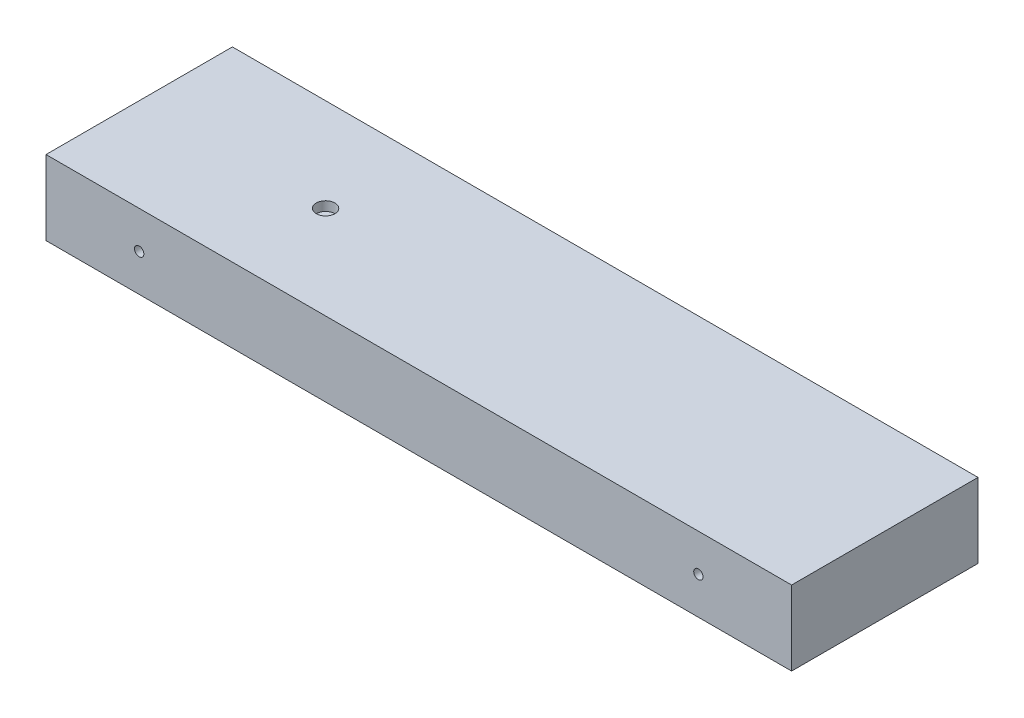
ISO-10303-21;
HEADER;
FILE_DESCRIPTION(('STEP AP214'),'2;1');
FILE_NAME('part.step','',(''),(''),'','','');
FILE_SCHEMA(('AUTOMOTIVE_DESIGN { 1 0 10303 214 1 1 1 1 }'));
ENDSEC;
DATA;
#1=APPLICATION_CONTEXT('core data for automotive mechanical design processes');
#2=APPLICATION_PROTOCOL_DEFINITION('international standard','automotive_design',2000,#1);
#3=PRODUCT_CONTEXT('',#1,'mechanical');
#4=PRODUCT('Part','Part','',(#3));
#5=PRODUCT_RELATED_PRODUCT_CATEGORY('part','',(#4));
#6=PRODUCT_DEFINITION_FORMATION('','',#4);
#7=PRODUCT_DEFINITION_CONTEXT('part definition',#1,'design');
#8=PRODUCT_DEFINITION('design','',#6,#7);
#9=PRODUCT_DEFINITION_SHAPE('','',#8);
#10=(LENGTH_UNIT() NAMED_UNIT(*) SI_UNIT(.MILLI.,.METRE.));
#11=(NAMED_UNIT(*) PLANE_ANGLE_UNIT() SI_UNIT($,.RADIAN.));
#12=(NAMED_UNIT(*) SI_UNIT($,.STERADIAN.) SOLID_ANGLE_UNIT());
#13=UNCERTAINTY_MEASURE_WITH_UNIT(LENGTH_MEASURE(1.E-05),#10,'distance_accuracy_value','');
#14=(GEOMETRIC_REPRESENTATION_CONTEXT(3) GLOBAL_UNCERTAINTY_ASSIGNED_CONTEXT((#13)) GLOBAL_UNIT_ASSIGNED_CONTEXT((#10,
#11,#12)) REPRESENTATION_CONTEXT('',''));
#15=CARTESIAN_POINT('',(0.,0.,0.));
#16=DIRECTION('',(0.,0.,1.));
#17=DIRECTION('',(1.,0.,0.));
#18=AXIS2_PLACEMENT_3D('',#15,#16,#17);
#19=CARTESIAN_POINT('',(0.,80.,0.));
#20=DIRECTION('',(1.,0.,0.));
#21=DIRECTION('',(0.,0.,-1.));
#22=AXIS2_PLACEMENT_3D('',#19,#20,#21);
#23=PLANE('',#22);
#24=DIRECTION('',(0.,0.,1.));
#25=VECTOR('',#24,1.);
#26=CARTESIAN_POINT('',(0.,0.,0.));
#27=LINE('',#26,#25);
#28=CARTESIAN_POINT('',(0.,0.,-200.));
#29=VERTEX_POINT('',#28);
#30=CARTESIAN_POINT('',(0.,0.,0.));
#31=VERTEX_POINT('',#30);
#32=EDGE_CURVE('E106',#29,#31,#27,.T.);
#33=ORIENTED_EDGE('',*,*,#32,.T.);
#34=DIRECTION('',(0.,-1.,0.));
#35=VECTOR('',#34,1.);
#36=CARTESIAN_POINT('',(0.,80.,0.));
#37=LINE('',#36,#35);
#38=CARTESIAN_POINT('',(0.,80.,0.));
#39=VERTEX_POINT('',#38);
#40=EDGE_CURVE('E11',#39,#31,#37,.T.);
#41=ORIENTED_EDGE('',*,*,#40,.F.);
#42=DIRECTION('',(0.,0.,1.));
#43=VECTOR('',#42,1.);
#44=CARTESIAN_POINT('',(0.,80.,0.));
#45=LINE('',#44,#43);
#46=CARTESIAN_POINT('',(0.,80.,-200.));
#47=VERTEX_POINT('',#46);
#48=EDGE_CURVE('E90',#47,#39,#45,.T.);
#49=ORIENTED_EDGE('',*,*,#48,.F.);
#50=DIRECTION('',(0.,-1.,0.));
#51=VECTOR('',#50,1.);
#52=CARTESIAN_POINT('',(0.,80.,-200.));
#53=LINE('',#52,#51);
#54=EDGE_CURVE('E102',#47,#29,#53,.T.);
#55=ORIENTED_EDGE('',*,*,#54,.T.);
#56=EDGE_LOOP('',(#33,#41,#49,#55));
#57=FACE_BOUND('',#56,.T.);
#58=ADVANCED_FACE('F38',(#57),#23,.F.);
#59=CARTESIAN_POINT('',(0.,80.,0.));
#60=DIRECTION('',(0.,0.,-1.));
#61=DIRECTION('',(-1.,0.,0.));
#62=AXIS2_PLACEMENT_3D('',#59,#60,#61);
#63=PLANE('',#62);
#64=CARTESIAN_POINT('',(100.,40.,0.));
#65=DIRECTION('',(0.,0.,1.));
#66=DIRECTION('',(1.,0.,0.));
#67=AXIS2_PLACEMENT_3D('',#64,#65,#66);
#68=CIRCLE('',#67,4.99999999999999);
#69=CARTESIAN_POINT('',(105.,40.,0.));
#70=VERTEX_POINT('',#69);
#71=EDGE_CURVE('E136',#70,#70,#68,.T.);
#72=ORIENTED_EDGE('',*,*,#71,.F.);
#73=EDGE_LOOP('',(#72));
#74=FACE_BOUND('',#73,.T.);
#75=CARTESIAN_POINT('',(700.,40.,0.));
#76=DIRECTION('',(0.,0.,1.));
#77=DIRECTION('',(1.,0.,0.));
#78=AXIS2_PLACEMENT_3D('',#75,#76,#77);
#79=CIRCLE('',#78,5.00000000000005);
#80=CARTESIAN_POINT('',(705.,40.,0.));
#81=VERTEX_POINT('',#80);
#82=EDGE_CURVE('E127',#81,#81,#79,.T.);
#83=ORIENTED_EDGE('',*,*,#82,.F.);
#84=EDGE_LOOP('',(#83));
#85=FACE_BOUND('',#84,.T.);
#86=DIRECTION('',(1.,0.,0.));
#87=VECTOR('',#86,1.);
#88=CARTESIAN_POINT('',(0.,0.,0.));
#89=LINE('',#88,#87);
#90=CARTESIAN_POINT('',(800.,0.,0.));
#91=VERTEX_POINT('',#90);
#92=EDGE_CURVE('E95',#31,#91,#89,.T.);
#93=ORIENTED_EDGE('',*,*,#92,.T.);
#94=DIRECTION('',(0.,-1.,0.));
#95=VECTOR('',#94,1.);
#96=CARTESIAN_POINT('',(800.,80.,0.));
#97=LINE('',#96,#95);
#98=CARTESIAN_POINT('',(800.,80.,0.));
#99=VERTEX_POINT('',#98);
#100=EDGE_CURVE('E47',#99,#91,#97,.T.);
#101=ORIENTED_EDGE('',*,*,#100,.F.);
#102=DIRECTION('',(1.,0.,0.));
#103=VECTOR('',#102,1.);
#104=CARTESIAN_POINT('',(0.,80.,0.));
#105=LINE('',#104,#103);
#106=EDGE_CURVE('E85',#39,#99,#105,.T.);
#107=ORIENTED_EDGE('',*,*,#106,.F.);
#108=ORIENTED_EDGE('',*,*,#40,.T.);
#109=EDGE_LOOP('',(#93,#101,#107,#108));
#110=FACE_BOUND('',#109,.T.);
#111=ADVANCED_FACE('F94',(#74,#85,#110),#63,.F.);
#112=CARTESIAN_POINT('',(800.,80.,0.));
#113=DIRECTION('',(-1.,0.,0.));
#114=DIRECTION('',(0.,0.,1.));
#115=AXIS2_PLACEMENT_3D('',#112,#113,#114);
#116=PLANE('',#115);
#117=DIRECTION('',(0.,0.,-1.));
#118=VECTOR('',#117,1.);
#119=CARTESIAN_POINT('',(800.,0.,0.));
#120=LINE('',#119,#118);
#121=CARTESIAN_POINT('',(800.,0.,-200.));
#122=VERTEX_POINT('',#121);
#123=EDGE_CURVE('E72',#91,#122,#120,.T.);
#124=ORIENTED_EDGE('',*,*,#123,.T.);
#125=DIRECTION('',(0.,-1.,0.));
#126=VECTOR('',#125,1.);
#127=CARTESIAN_POINT('',(800.,80.,-200.));
#128=LINE('',#127,#126);
#129=CARTESIAN_POINT('',(800.,80.,-200.));
#130=VERTEX_POINT('',#129);
#131=EDGE_CURVE('E97',#130,#122,#128,.T.);
#132=ORIENTED_EDGE('',*,*,#131,.F.);
#133=DIRECTION('',(0.,0.,-1.));
#134=VECTOR('',#133,1.);
#135=CARTESIAN_POINT('',(800.,80.,0.));
#136=LINE('',#135,#134);
#137=EDGE_CURVE('E88',#99,#130,#136,.T.);
#138=ORIENTED_EDGE('',*,*,#137,.F.);
#139=ORIENTED_EDGE('',*,*,#100,.T.);
#140=EDGE_LOOP('',(#124,#132,#138,#139));
#141=FACE_BOUND('',#140,.T.);
#142=ADVANCED_FACE('F98',(#141),#116,.F.);
#143=CARTESIAN_POINT('',(0.,80.,-200.));
#144=DIRECTION('',(0.,0.,1.));
#145=DIRECTION('',(1.,0.,0.));
#146=AXIS2_PLACEMENT_3D('',#143,#144,#145);
#147=PLANE('',#146);
#148=CARTESIAN_POINT('',(100.,40.,-200.));
#149=DIRECTION('',(0.,0.,1.));
#150=DIRECTION('',(1.,0.,0.));
#151=AXIS2_PLACEMENT_3D('',#148,#149,#150);
#152=CIRCLE('',#151,4.99999999999999);
#153=CARTESIAN_POINT('',(105.,40.,-200.));
#154=VERTEX_POINT('',#153);
#155=EDGE_CURVE('E110',#154,#154,#152,.T.);
#156=ORIENTED_EDGE('',*,*,#155,.T.);
#157=EDGE_LOOP('',(#156));
#158=FACE_BOUND('',#157,.T.);
#159=CARTESIAN_POINT('',(700.,40.,-200.));
#160=DIRECTION('',(0.,0.,1.));
#161=DIRECTION('',(1.,0.,0.));
#162=AXIS2_PLACEMENT_3D('',#159,#160,#161);
#163=CIRCLE('',#162,5.00000000000005);
#164=CARTESIAN_POINT('',(705.,40.,-200.));
#165=VERTEX_POINT('',#164);
#166=EDGE_CURVE('E131',#165,#165,#163,.T.);
#167=ORIENTED_EDGE('',*,*,#166,.T.);
#168=EDGE_LOOP('',(#167));
#169=FACE_BOUND('',#168,.T.);
#170=DIRECTION('',(-1.,0.,0.));
#171=VECTOR('',#170,1.);
#172=CARTESIAN_POINT('',(0.,0.,-200.));
#173=LINE('',#172,#171);
#174=EDGE_CURVE('E78',#122,#29,#173,.T.);
#175=ORIENTED_EDGE('',*,*,#174,.T.);
#176=ORIENTED_EDGE('',*,*,#54,.F.);
#177=DIRECTION('',(-1.,0.,0.));
#178=VECTOR('',#177,1.);
#179=CARTESIAN_POINT('',(0.,80.,-200.));
#180=LINE('',#179,#178);
#181=EDGE_CURVE('E55',#130,#47,#180,.T.);
#182=ORIENTED_EDGE('',*,*,#181,.F.);
#183=ORIENTED_EDGE('',*,*,#131,.T.);
#184=EDGE_LOOP('',(#175,#176,#182,#183));
#185=FACE_BOUND('',#184,.T.);
#186=ADVANCED_FACE('F120',(#158,#169,#185),#147,.F.);
#187=CARTESIAN_POINT('',(0.,80.,0.));
#188=DIRECTION('',(0.,-1.,0.));
#189=DIRECTION('',(0.,0.,-1.));
#190=AXIS2_PLACEMENT_3D('',#187,#188,#189);
#191=PLANE('',#190);
#192=CARTESIAN_POINT('',(200.,80.,-100.));
#193=DIRECTION('',(0.,1.,0.));
#194=DIRECTION('',(0.,0.,1.));
#195=AXIS2_PLACEMENT_3D('',#192,#193,#194);
#196=CIRCLE('',#195,10.);
#197=CARTESIAN_POINT('',(200.,80.,-90.));
#198=VERTEX_POINT('',#197);
#199=EDGE_CURVE('E143',#198,#198,#196,.T.);
#200=ORIENTED_EDGE('',*,*,#199,.F.);
#201=EDGE_LOOP('',(#200));
#202=FACE_BOUND('',#201,.T.);
#203=ORIENTED_EDGE('',*,*,#48,.T.);
#204=ORIENTED_EDGE('',*,*,#106,.T.);
#205=ORIENTED_EDGE('',*,*,#137,.T.);
#206=ORIENTED_EDGE('',*,*,#181,.T.);
#207=EDGE_LOOP('',(#203,#204,#205,#206));
#208=FACE_BOUND('',#207,.T.);
#209=ADVANCED_FACE('F86',(#202,#208),#191,.F.);
#210=CARTESIAN_POINT('',(0.,0.,0.));
#211=DIRECTION('',(0.,-1.,0.));
#212=DIRECTION('',(0.,0.,-1.));
#213=AXIS2_PLACEMENT_3D('',#210,#211,#212);
#214=PLANE('',#213);
#215=ORIENTED_EDGE('',*,*,#32,.F.);
#216=ORIENTED_EDGE('',*,*,#174,.F.);
#217=ORIENTED_EDGE('',*,*,#123,.F.);
#218=ORIENTED_EDGE('',*,*,#92,.F.);
#219=EDGE_LOOP('',(#215,#216,#217,#218));
#220=FACE_BOUND('',#219,.T.);
#221=ADVANCED_FACE('F123',(#220),#214,.T.);
#222=CARTESIAN_POINT('',(700.,40.,-200.));
#223=DIRECTION('',(0.,0.,1.));
#224=DIRECTION('',(1.,0.,0.));
#225=AXIS2_PLACEMENT_3D('',#222,#223,#224);
#226=CYLINDRICAL_SURFACE('',#225,5.00000000000005);
#227=ORIENTED_EDGE('',*,*,#166,.F.);
#228=EDGE_LOOP('',(#227));
#229=FACE_BOUND('',#228,.T.);
#230=ORIENTED_EDGE('',*,*,#82,.T.);
#231=EDGE_LOOP('',(#230));
#232=FACE_BOUND('',#231,.T.);
#233=ADVANCED_FACE('F167',(#229,#232),#226,.F.);
#234=CARTESIAN_POINT('',(100.,40.,-200.));
#235=DIRECTION('',(0.,0.,1.));
#236=DIRECTION('',(1.,0.,0.));
#237=AXIS2_PLACEMENT_3D('',#234,#235,#236);
#238=CYLINDRICAL_SURFACE('',#237,4.99999999999999);
#239=ORIENTED_EDGE('',*,*,#155,.F.);
#240=EDGE_LOOP('',(#239));
#241=FACE_BOUND('',#240,.T.);
#242=ORIENTED_EDGE('',*,*,#71,.T.);
#243=EDGE_LOOP('',(#242));
#244=FACE_BOUND('',#243,.T.);
#245=ADVANCED_FACE('F156',(#241,#244),#238,.F.);
#246=CARTESIAN_POINT('',(200.,70.,-100.));
#247=DIRECTION('',(0.,1.,0.));
#248=DIRECTION('',(0.,0.,1.));
#249=AXIS2_PLACEMENT_3D('',#246,#247,#248);
#250=CYLINDRICAL_SURFACE('',#249,10.);
#251=CARTESIAN_POINT('',(200.,70.,-100.));
#252=DIRECTION('',(0.,1.,0.));
#253=DIRECTION('',(0.,0.,1.));
#254=AXIS2_PLACEMENT_3D('',#251,#252,#253);
#255=CIRCLE('',#254,10.);
#256=CARTESIAN_POINT('',(200.,70.,-90.));
#257=VERTEX_POINT('',#256);
#258=EDGE_CURVE('E132',#257,#257,#255,.T.);
#259=ORIENTED_EDGE('',*,*,#258,.F.);
#260=EDGE_LOOP('',(#259));
#261=FACE_BOUND('',#260,.T.);
#262=ORIENTED_EDGE('',*,*,#199,.T.);
#263=EDGE_LOOP('',(#262));
#264=FACE_BOUND('',#263,.T.);
#265=ADVANCED_FACE('F153',(#261,#264),#250,.F.);
#266=CARTESIAN_POINT('',(200.,70.,-100.));
#267=DIRECTION('',(0.,1.,0.));
#268=DIRECTION('',(0.,0.,1.));
#269=AXIS2_PLACEMENT_3D('',#266,#267,#268);
#270=PLANE('',#269);
#271=ORIENTED_EDGE('',*,*,#258,.T.);
#272=EDGE_LOOP('',(#271));
#273=FACE_BOUND('',#272,.T.);
#274=ADVANCED_FACE('F151',(#273),#270,.T.);
#275=CLOSED_SHELL('',(#58,#111,#142,#186,#209,#221,#233,#245,#265,#274));
#276=MANIFOLD_SOLID_BREP('B2',#275);
#277=ADVANCED_BREP_SHAPE_REPRESENTATION('',(#18,#276),#14);
#278=SHAPE_DEFINITION_REPRESENTATION(#9,#277);
ENDSEC;
END-ISO-10303-21;
